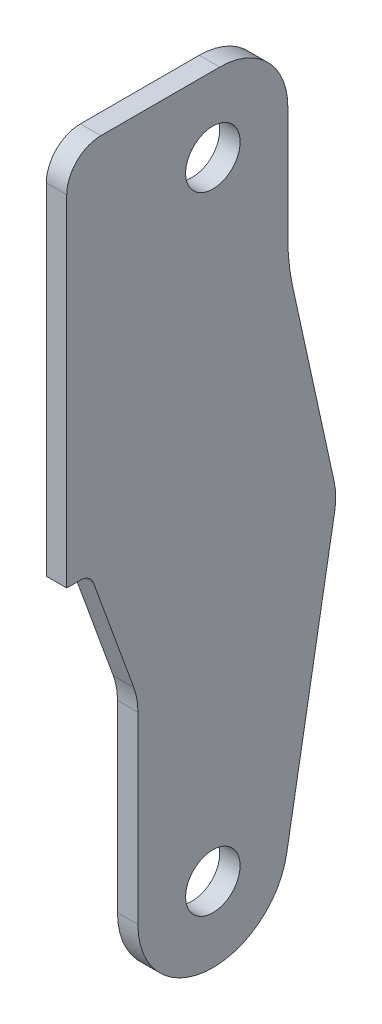
ISO-10303-21;
HEADER;
FILE_DESCRIPTION(('STEP AP214'),'2;1');
FILE_NAME('part.step','',(''),(''),'','','');
FILE_SCHEMA(('AUTOMOTIVE_DESIGN { 1 0 10303 214 1 1 1 1 }'));
ENDSEC;
DATA;
#1=APPLICATION_CONTEXT('core data for automotive mechanical design processes');
#2=APPLICATION_PROTOCOL_DEFINITION('international standard','automotive_design',2000,#1);
#3=PRODUCT_CONTEXT('',#1,'mechanical');
#4=PRODUCT('Part','Part','',(#3));
#5=PRODUCT_RELATED_PRODUCT_CATEGORY('part','',(#4));
#6=PRODUCT_DEFINITION_FORMATION('','',#4);
#7=PRODUCT_DEFINITION_CONTEXT('part definition',#1,'design');
#8=PRODUCT_DEFINITION('design','',#6,#7);
#9=PRODUCT_DEFINITION_SHAPE('','',#8);
#10=(LENGTH_UNIT() NAMED_UNIT(*) SI_UNIT(.MILLI.,.METRE.));
#11=(NAMED_UNIT(*) PLANE_ANGLE_UNIT() SI_UNIT($,.RADIAN.));
#12=(NAMED_UNIT(*) SI_UNIT($,.STERADIAN.) SOLID_ANGLE_UNIT());
#13=UNCERTAINTY_MEASURE_WITH_UNIT(LENGTH_MEASURE(1.E-05),#10,'distance_accuracy_value','');
#14=(GEOMETRIC_REPRESENTATION_CONTEXT(3) GLOBAL_UNCERTAINTY_ASSIGNED_CONTEXT((#13)) GLOBAL_UNIT_ASSIGNED_CONTEXT((#10,
#11,#12)) REPRESENTATION_CONTEXT('',''));
#15=CARTESIAN_POINT('',(0.,0.,0.));
#16=DIRECTION('',(0.,0.,1.));
#17=DIRECTION('',(1.,0.,0.));
#18=AXIS2_PLACEMENT_3D('',#15,#16,#17);
#19=CARTESIAN_POINT('',(17.5,-190.,21.4494897427832));
#20=DIRECTION('',(0.,0.,1.));
#21=DIRECTION('',(1.,0.,0.));
#22=AXIS2_PLACEMENT_3D('',#19,#20,#21);
#23=PLANE('',#22);
#24=DIRECTION('',(0.,1.,0.));
#25=VECTOR('',#24,1.);
#26=CARTESIAN_POINT('',(17.5,-190.,21.4494897427832));
#27=LINE('',#26,#25);
#28=CARTESIAN_POINT('',(17.5,-190.,21.4494897427832));
#29=VERTEX_POINT('',#28);
#30=CARTESIAN_POINT('',(17.5,-140.,21.4494897427832));
#31=VERTEX_POINT('',#30);
#32=EDGE_CURVE('E184',#29,#31,#27,.T.);
#33=ORIENTED_EDGE('',*,*,#32,.T.);
#34=DIRECTION('',(-1.,0.,0.));
#35=VECTOR('',#34,1.);
#36=CARTESIAN_POINT('',(17.5,-140.,21.4494897427832));
#37=LINE('',#36,#35);
#38=CARTESIAN_POINT('',(14.5,-140.,21.4494897427832));
#39=VERTEX_POINT('',#38);
#40=EDGE_CURVE('E252',#31,#39,#37,.T.);
#41=ORIENTED_EDGE('',*,*,#40,.T.);
#42=DIRECTION('',(0.,1.,0.));
#43=VECTOR('',#42,1.);
#44=CARTESIAN_POINT('',(14.5,-190.,21.4494897427832));
#45=LINE('',#44,#43);
#46=CARTESIAN_POINT('',(14.5,-190.,21.4494897427832));
#47=VERTEX_POINT('',#46);
#48=EDGE_CURVE('E180',#47,#39,#45,.T.);
#49=ORIENTED_EDGE('',*,*,#48,.F.);
#50=DIRECTION('',(-1.,0.,0.));
#51=VECTOR('',#50,1.);
#52=CARTESIAN_POINT('',(17.5,-190.,21.4494897427832));
#53=LINE('',#52,#51);
#54=EDGE_CURVE('E250',#29,#47,#53,.T.);
#55=ORIENTED_EDGE('',*,*,#54,.F.);
#56=EDGE_LOOP('',(#33,#41,#49,#55));
#57=FACE_BOUND('',#56,.T.);
#58=ADVANCED_FACE('F39',(#57),#23,.T.);
#59=CARTESIAN_POINT('',(17.5,-190.000000000001,19.40041507642));
#60=DIRECTION('',(0.,-1.,5.28271354274638E-13));
#61=DIRECTION('',(0.,-5.28271354274638E-13,-1.));
#62=AXIS2_PLACEMENT_3D('',#59,#60,#61);
#63=PLANE('',#62);
#64=ORIENTED_EDGE('',*,*,#54,.T.);
#65=DIRECTION('',(0.,5.28271354274638E-13,1.));
#66=VECTOR('',#65,1.);
#67=CARTESIAN_POINT('',(14.5,-190.000000000001,19.40041507642));
#68=LINE('',#67,#66);
#69=CARTESIAN_POINT('',(14.5,-190.000000000002,19.40041507642));
#70=VERTEX_POINT('',#69);
#71=EDGE_CURVE('E188',#70,#47,#68,.T.);
#72=ORIENTED_EDGE('',*,*,#71,.F.);
#73=DIRECTION('',(-1.,0.,0.));
#74=VECTOR('',#73,1.);
#75=CARTESIAN_POINT('',(17.5,-190.000000000002,19.40041507642));
#76=LINE('',#75,#74);
#77=CARTESIAN_POINT('',(17.5,-190.000000000002,19.40041507642));
#78=VERTEX_POINT('',#77);
#79=EDGE_CURVE('E253',#78,#70,#76,.T.);
#80=ORIENTED_EDGE('',*,*,#79,.F.);
#81=DIRECTION('',(0.,5.28271354274638E-13,1.));
#82=VECTOR('',#81,1.);
#83=CARTESIAN_POINT('',(17.5,-190.000000000001,19.40041507642));
#84=LINE('',#83,#82);
#85=EDGE_CURVE('E218',#78,#29,#84,.T.);
#86=ORIENTED_EDGE('',*,*,#85,.T.);
#87=EDGE_LOOP('',(#64,#72,#80,#86));
#88=FACE_BOUND('',#87,.T.);
#89=ADVANCED_FACE('F283',(#88),#63,.T.);
#90=CARTESIAN_POINT('',(17.5,-192.,19.40041507642));
#91=DIRECTION('',(-1.,0.,0.));
#92=DIRECTION('',(0.,0.,1.));
#93=AXIS2_PLACEMENT_3D('',#90,#91,#92);
#94=CYLINDRICAL_SURFACE('',#93,1.99999999999838);
#95=ORIENTED_EDGE('',*,*,#79,.T.);
#96=CARTESIAN_POINT('',(14.5,-192.,19.40041507642));
#97=DIRECTION('',(1.,0.,0.));
#98=DIRECTION('',(0.,0.,1.));
#99=AXIS2_PLACEMENT_3D('',#96,#97,#98);
#100=CIRCLE('',#99,1.99999999999838);
#101=CARTESIAN_POINT('',(14.5,-191.31595971335,17.52102983485));
#102=VERTEX_POINT('',#101);
#103=EDGE_CURVE('E245',#102,#70,#100,.T.);
#104=ORIENTED_EDGE('',*,*,#103,.F.);
#105=DIRECTION('',(-1.,0.,0.));
#106=VECTOR('',#105,1.);
#107=CARTESIAN_POINT('',(17.5,-191.31595971335,17.52102983485));
#108=LINE('',#107,#106);
#109=CARTESIAN_POINT('',(17.5,-191.31595971335,17.52102983485));
#110=VERTEX_POINT('',#109);
#111=EDGE_CURVE('E255',#110,#102,#108,.T.);
#112=ORIENTED_EDGE('',*,*,#111,.F.);
#113=CARTESIAN_POINT('',(17.5,-192.,19.40041507642));
#114=DIRECTION('',(1.,0.,0.));
#115=DIRECTION('',(0.,0.,1.));
#116=AXIS2_PLACEMENT_3D('',#113,#114,#115);
#117=CIRCLE('',#116,1.99999999999838);
#118=EDGE_CURVE('E215',#110,#78,#117,.T.);
#119=ORIENTED_EDGE('',*,*,#118,.T.);
#120=EDGE_LOOP('',(#95,#104,#112,#119));
#121=FACE_BOUND('',#120,.T.);
#122=ADVANCED_FACE('F303',(#121),#94,.F.);
#123=CARTESIAN_POINT('',(17.5,-207.57541031001,11.6030737921409));
#124=DIRECTION('',(0.,-0.342020143325815,0.939692620785855));
#125=DIRECTION('',(0.,-0.939692620785855,-0.342020143325815));
#126=AXIS2_PLACEMENT_3D('',#123,#124,#125);
#127=PLANE('',#126);
#128=ORIENTED_EDGE('',*,*,#111,.T.);
#129=DIRECTION('',(0.,0.939692620785855,0.342020143325814));
#130=VECTOR('',#129,1.);
#131=CARTESIAN_POINT('',(14.5,-207.57541031001,11.6030737921409));
#132=LINE('',#131,#130);
#133=CARTESIAN_POINT('',(14.5,-207.575410310011,11.6030737921414));
#134=VERTEX_POINT('',#133);
#135=EDGE_CURVE('E242',#134,#102,#132,.T.);
#136=ORIENTED_EDGE('',*,*,#135,.F.);
#137=DIRECTION('',(-1.,0.,0.));
#138=VECTOR('',#137,1.);
#139=CARTESIAN_POINT('',(17.5,-207.575410310011,11.6030737921414));
#140=LINE('',#139,#138);
#141=CARTESIAN_POINT('',(17.5,-207.575410310011,11.6030737921414));
#142=VERTEX_POINT('',#141);
#143=EDGE_CURVE('E257',#142,#134,#140,.T.);
#144=ORIENTED_EDGE('',*,*,#143,.F.);
#145=DIRECTION('',(0.,0.939692620785855,0.342020143325814));
#146=VECTOR('',#145,1.);
#147=CARTESIAN_POINT('',(17.5,-207.57541031001,11.6030737921409));
#148=LINE('',#147,#146);
#149=EDGE_CURVE('E212',#142,#110,#148,.T.);
#150=ORIENTED_EDGE('',*,*,#149,.T.);
#151=EDGE_LOOP('',(#128,#136,#144,#150));
#152=FACE_BOUND('',#151,.T.);
#153=ADVANCED_FACE('F338',(#152),#127,.T.);
#154=CARTESIAN_POINT('',(17.5,-210.99561174327,21.));
#155=DIRECTION('',(-1.,0.,0.));
#156=DIRECTION('',(0.,0.,1.));
#157=AXIS2_PLACEMENT_3D('',#154,#155,#156);
#158=CYLINDRICAL_SURFACE('',#157,10.0000000000005);
#159=ORIENTED_EDGE('',*,*,#143,.T.);
#160=CARTESIAN_POINT('',(14.5,-210.99561174327,21.));
#161=DIRECTION('',(1.,0.,0.));
#162=DIRECTION('',(0.,0.,1.));
#163=AXIS2_PLACEMENT_3D('',#160,#161,#162);
#164=CIRCLE('',#163,10.0000000000005);
#165=CARTESIAN_POINT('',(14.5,-210.99561174327,11.));
#166=VERTEX_POINT('',#165);
#167=EDGE_CURVE('E239',#166,#134,#164,.T.);
#168=ORIENTED_EDGE('',*,*,#167,.F.);
#169=DIRECTION('',(-1.,0.,0.));
#170=VECTOR('',#169,1.);
#171=CARTESIAN_POINT('',(17.5,-210.99561174327,11.));
#172=LINE('',#171,#170);
#173=CARTESIAN_POINT('',(17.5,-210.99561174327,11.));
#174=VERTEX_POINT('',#173);
#175=EDGE_CURVE('E259',#174,#166,#172,.T.);
#176=ORIENTED_EDGE('',*,*,#175,.F.);
#177=CARTESIAN_POINT('',(17.5,-210.99561174327,21.));
#178=DIRECTION('',(1.,0.,0.));
#179=DIRECTION('',(0.,0.,1.));
#180=AXIS2_PLACEMENT_3D('',#177,#178,#179);
#181=CIRCLE('',#180,10.0000000000005);
#182=EDGE_CURVE('E209',#174,#142,#181,.T.);
#183=ORIENTED_EDGE('',*,*,#182,.T.);
#184=EDGE_LOOP('',(#159,#168,#176,#183));
#185=FACE_BOUND('',#184,.T.);
#186=ADVANCED_FACE('F334',(#185),#158,.F.);
#187=CARTESIAN_POINT('',(17.5,-238.,10.9999999999979));
#188=DIRECTION('',(0.,0.,1.));
#189=DIRECTION('',(0.,-1.,0.));
#190=AXIS2_PLACEMENT_3D('',#187,#188,#189);
#191=PLANE('',#190);
#192=ORIENTED_EDGE('',*,*,#175,.T.);
#193=DIRECTION('',(0.,1.,0.));
#194=VECTOR('',#193,1.);
#195=CARTESIAN_POINT('',(14.5,-238.,10.9999999999979));
#196=LINE('',#195,#194);
#197=CARTESIAN_POINT('',(14.5,-238.,10.9999999999969));
#198=VERTEX_POINT('',#197);
#199=EDGE_CURVE('E236',#198,#166,#196,.T.);
#200=ORIENTED_EDGE('',*,*,#199,.F.);
#201=DIRECTION('',(-1.,0.,0.));
#202=VECTOR('',#201,1.);
#203=CARTESIAN_POINT('',(17.5,-238.,10.9999999999969));
#204=LINE('',#203,#202);
#205=CARTESIAN_POINT('',(17.5,-238.,10.9999999999969));
#206=VERTEX_POINT('',#205);
#207=EDGE_CURVE('E261',#206,#198,#204,.T.);
#208=ORIENTED_EDGE('',*,*,#207,.F.);
#209=DIRECTION('',(0.,1.,0.));
#210=VECTOR('',#209,1.);
#211=CARTESIAN_POINT('',(17.5,-238.,10.9999999999979));
#212=LINE('',#211,#210);
#213=EDGE_CURVE('E206',#206,#174,#212,.T.);
#214=ORIENTED_EDGE('',*,*,#213,.T.);
#215=EDGE_LOOP('',(#192,#200,#208,#214));
#216=FACE_BOUND('',#215,.T.);
#217=ADVANCED_FACE('F330',(#216),#191,.T.);
#218=CARTESIAN_POINT('',(17.5,-238.,0.));
#219=DIRECTION('',(-1.,0.,0.));
#220=DIRECTION('',(0.,0.,1.));
#221=AXIS2_PLACEMENT_3D('',#218,#219,#220);
#222=CYLINDRICAL_SURFACE('',#221,10.9999999999969);
#223=ORIENTED_EDGE('',*,*,#207,.T.);
#224=CARTESIAN_POINT('',(14.5,-238.,0.));
#225=DIRECTION('',(-1.,0.,0.));
#226=DIRECTION('',(0.,0.,1.));
#227=AXIS2_PLACEMENT_3D('',#224,#225,#226);
#228=CIRCLE('',#227,10.9999999999969);
#229=CARTESIAN_POINT('',(14.5,-239.91012995434,-10.83288528313));
#230=VERTEX_POINT('',#229);
#231=EDGE_CURVE('E233',#230,#198,#228,.T.);
#232=ORIENTED_EDGE('',*,*,#231,.F.);
#233=DIRECTION('',(-1.,0.,0.));
#234=VECTOR('',#233,1.);
#235=CARTESIAN_POINT('',(17.5,-239.91012995434,-10.83288528313));
#236=LINE('',#235,#234);
#237=CARTESIAN_POINT('',(17.5,-239.91012995434,-10.83288528313));
#238=VERTEX_POINT('',#237);
#239=EDGE_CURVE('E263',#238,#230,#236,.T.);
#240=ORIENTED_EDGE('',*,*,#239,.F.);
#241=CARTESIAN_POINT('',(17.5,-238.,0.));
#242=DIRECTION('',(-1.,0.,0.));
#243=DIRECTION('',(0.,0.,1.));
#244=AXIS2_PLACEMENT_3D('',#241,#242,#243);
#245=CIRCLE('',#244,10.9999999999963);
#246=EDGE_CURVE('E204',#238,#206,#245,.T.);
#247=ORIENTED_EDGE('',*,*,#246,.T.);
#248=EDGE_LOOP('',(#223,#232,#240,#247));
#249=FACE_BOUND('',#248,.T.);
#250=ADVANCED_FACE('F326',(#249),#222,.T.);
#251=CARTESIAN_POINT('',(17.5,-199.94512735731,-17.8797935250715));
#252=DIRECTION('',(0.,-0.173648177666962,-0.984807753012202));
#253=DIRECTION('',(0.,0.984807753012202,-0.173648177666962));
#254=AXIS2_PLACEMENT_3D('',#251,#252,#253);
#255=PLANE('',#254);
#256=ORIENTED_EDGE('',*,*,#239,.T.);
#257=DIRECTION('',(0.,-0.984807753012202,0.173648177666962));
#258=VECTOR('',#257,1.);
#259=CARTESIAN_POINT('',(14.5,-199.94512735731,-17.8797935250715));
#260=LINE('',#259,#258);
#261=CARTESIAN_POINT('',(14.5,-199.94512735731,-17.8797935250723));
#262=VERTEX_POINT('',#261);
#263=EDGE_CURVE('E230',#262,#230,#260,.T.);
#264=ORIENTED_EDGE('',*,*,#263,.F.);
#265=DIRECTION('',(-1.,0.,0.));
#266=VECTOR('',#265,1.);
#267=CARTESIAN_POINT('',(17.5,-199.94512735731,-17.8797935250723));
#268=LINE('',#267,#266);
#269=CARTESIAN_POINT('',(17.5,-199.94512735731,-17.8797935250723));
#270=VERTEX_POINT('',#269);
#271=EDGE_CURVE('E265',#270,#262,#268,.T.);
#272=ORIENTED_EDGE('',*,*,#271,.F.);
#273=DIRECTION('',(0.,-0.984807753012202,0.173648177666962));
#274=VECTOR('',#273,1.);
#275=CARTESIAN_POINT('',(17.5,-199.94512735731,-17.8797935250715));
#276=LINE('',#275,#274);
#277=EDGE_CURVE('E201',#270,#238,#276,.T.);
#278=ORIENTED_EDGE('',*,*,#277,.T.);
#279=EDGE_LOOP('',(#256,#264,#272,#278));
#280=FACE_BOUND('',#279,.T.);
#281=ADVANCED_FACE('F322',(#280),#255,.T.);
#282=CARTESIAN_POINT('',(17.5,-198.20864558064,-8.031715994952));
#283=DIRECTION('',(-1.,0.,0.));
#284=DIRECTION('',(0.,0.,1.));
#285=AXIS2_PLACEMENT_3D('',#282,#283,#284);
#286=CYLINDRICAL_SURFACE('',#285,9.99999999999843);
#287=ORIENTED_EDGE('',*,*,#271,.T.);
#288=CARTESIAN_POINT('',(14.5,-198.20864558064,-8.031715994952));
#289=DIRECTION('',(-1.,0.,0.));
#290=DIRECTION('',(0.,0.,1.));
#291=AXIS2_PLACEMENT_3D('',#288,#289,#290);
#292=CIRCLE('',#291,9.99999999999843);
#293=CARTESIAN_POINT('',(14.5,-196.07054058552,-17.80046755438));
#294=VERTEX_POINT('',#293);
#295=EDGE_CURVE('E227',#294,#262,#292,.T.);
#296=ORIENTED_EDGE('',*,*,#295,.F.);
#297=DIRECTION('',(-1.,0.,0.));
#298=VECTOR('',#297,1.);
#299=CARTESIAN_POINT('',(17.5,-196.07054058552,-17.80046755438));
#300=LINE('',#299,#298);
#301=CARTESIAN_POINT('',(17.5,-196.07054058552,-17.80046755438));
#302=VERTEX_POINT('',#301);
#303=EDGE_CURVE('E267',#302,#294,#300,.T.);
#304=ORIENTED_EDGE('',*,*,#303,.F.);
#305=CARTESIAN_POINT('',(17.5,-198.20864558064,-8.031715994952));
#306=DIRECTION('',(-1.,0.,0.));
#307=DIRECTION('',(0.,0.,1.));
#308=AXIS2_PLACEMENT_3D('',#305,#306,#307);
#309=CIRCLE('',#308,9.99999999999843);
#310=EDGE_CURVE('E198',#302,#270,#309,.T.);
#311=ORIENTED_EDGE('',*,*,#310,.T.);
#312=EDGE_LOOP('',(#287,#296,#304,#311));
#313=FACE_BOUND('',#312,.T.);
#314=ADVANCED_FACE('F318',(#313),#286,.T.);
#315=CARTESIAN_POINT('',(17.5,-168.16964120508,-11.6937453217096));
#316=DIRECTION('',(0.,0.213810499511105,-0.976875155943077));
#317=DIRECTION('',(0.,0.976875155943077,0.213810499511105));
#318=AXIS2_PLACEMENT_3D('',#315,#316,#317);
#319=PLANE('',#318);
#320=ORIENTED_EDGE('',*,*,#303,.T.);
#321=DIRECTION('',(0.,-0.976875155943077,-0.213810499511105));
#322=VECTOR('',#321,1.);
#323=CARTESIAN_POINT('',(14.5,-168.16964120508,-11.6937453217096));
#324=LINE('',#323,#322);
#325=CARTESIAN_POINT('',(14.5,-168.16964120508,-11.6937453217094));
#326=VERTEX_POINT('',#325);
#327=EDGE_CURVE('E224',#326,#294,#324,.T.);
#328=ORIENTED_EDGE('',*,*,#327,.F.);
#329=DIRECTION('',(-1.,0.,0.));
#330=VECTOR('',#329,1.);
#331=CARTESIAN_POINT('',(17.5,-168.16964120508,-11.6937453217094));
#332=LINE('',#331,#330);
#333=CARTESIAN_POINT('',(17.5,-168.16964120508,-11.6937453217094));
#334=VERTEX_POINT('',#333);
#335=EDGE_CURVE('E269',#334,#326,#332,.T.);
#336=ORIENTED_EDGE('',*,*,#335,.F.);
#337=DIRECTION('',(0.,-0.976875155943077,-0.213810499511105));
#338=VECTOR('',#337,1.);
#339=CARTESIAN_POINT('',(17.5,-168.16964120508,-11.6937453217096));
#340=LINE('',#339,#338);
#341=EDGE_CURVE('E195',#334,#302,#340,.T.);
#342=ORIENTED_EDGE('',*,*,#341,.T.);
#343=EDGE_LOOP('',(#320,#328,#336,#342));
#344=FACE_BOUND('',#343,.T.);
#345=ADVANCED_FACE('F314',(#344),#319,.T.);
#346=CARTESIAN_POINT('',(17.5,-161.75532621974,-41.));
#347=DIRECTION('',(-1.,0.,0.));
#348=DIRECTION('',(0.,0.,1.));
#349=AXIS2_PLACEMENT_3D('',#346,#347,#348);
#350=CYLINDRICAL_SURFACE('',#349,29.9999999999998);
#351=ORIENTED_EDGE('',*,*,#335,.T.);
#352=CARTESIAN_POINT('',(14.5,-161.75532621974,-41.));
#353=DIRECTION('',(1.,0.,0.));
#354=DIRECTION('',(0.,0.,1.));
#355=AXIS2_PLACEMENT_3D('',#352,#353,#354);
#356=CIRCLE('',#355,29.9999999999998);
#357=CARTESIAN_POINT('',(14.5,-161.75532621974,-11.));
#358=VERTEX_POINT('',#357);
#359=EDGE_CURVE('E153',#358,#326,#356,.T.);
#360=ORIENTED_EDGE('',*,*,#359,.F.);
#361=DIRECTION('',(-1.,0.,0.));
#362=VECTOR('',#361,1.);
#363=CARTESIAN_POINT('',(17.5,-161.75532621974,-11.));
#364=LINE('',#363,#362);
#365=CARTESIAN_POINT('',(17.5,-161.75532621974,-11.));
#366=VERTEX_POINT('',#365);
#367=EDGE_CURVE('E149',#366,#358,#364,.T.);
#368=ORIENTED_EDGE('',*,*,#367,.F.);
#369=CARTESIAN_POINT('',(17.5,-161.75532621974,-41.));
#370=DIRECTION('',(1.,0.,0.));
#371=DIRECTION('',(0.,0.,1.));
#372=AXIS2_PLACEMENT_3D('',#369,#370,#371);
#373=CIRCLE('',#372,29.9999999999998);
#374=EDGE_CURVE('E192',#366,#334,#373,.T.);
#375=ORIENTED_EDGE('',*,*,#374,.T.);
#376=EDGE_LOOP('',(#351,#360,#368,#375));
#377=FACE_BOUND('',#376,.T.);
#378=ADVANCED_FACE('F311',(#377),#350,.F.);
#379=CARTESIAN_POINT('',(17.5,-153.292893218813,-10.9999999999989));
#380=DIRECTION('',(0.,1.32834234824646E-13,-1.));
#381=DIRECTION('',(0.,1.,1.32834234824646E-13));
#382=AXIS2_PLACEMENT_3D('',#379,#380,#381);
#383=PLANE('',#382);
#384=ORIENTED_EDGE('',*,*,#367,.T.);
#385=DIRECTION('',(0.,-1.,-1.32834234824646E-13));
#386=VECTOR('',#385,1.);
#387=CARTESIAN_POINT('',(14.5,-153.292893218813,-10.9999999999989));
#388=LINE('',#387,#386);
#389=CARTESIAN_POINT('',(14.5,-145.,-10.9999999999983));
#390=VERTEX_POINT('',#389);
#391=EDGE_CURVE('E144',#390,#358,#388,.T.);
#392=ORIENTED_EDGE('',*,*,#391,.F.);
#393=DIRECTION('',(-1.,0.,0.));
#394=VECTOR('',#393,1.);
#395=CARTESIAN_POINT('',(43.370057685087,-145.,-10.9999999999983));
#396=LINE('',#395,#394);
#397=CARTESIAN_POINT('',(17.5,-145.,-10.9999999999983));
#398=VERTEX_POINT('',#397);
#399=EDGE_CURVE('E148',#398,#390,#396,.T.);
#400=ORIENTED_EDGE('',*,*,#399,.F.);
#401=DIRECTION('',(0.,-1.,-1.32834234824646E-13));
#402=VECTOR('',#401,1.);
#403=CARTESIAN_POINT('',(17.5,-153.292893218813,-10.9999999999989));
#404=LINE('',#403,#402);
#405=EDGE_CURVE('E190',#398,#366,#404,.T.);
#406=ORIENTED_EDGE('',*,*,#405,.T.);
#407=EDGE_LOOP('',(#384,#392,#400,#406));
#408=FACE_BOUND('',#407,.T.);
#409=ADVANCED_FACE('F146',(#408),#383,.T.);
#410=CARTESIAN_POINT('',(17.5,-135.,21.4494897427832));
#411=DIRECTION('',(0.,1.,0.));
#412=DIRECTION('',(0.,0.,1.));
#413=AXIS2_PLACEMENT_3D('',#410,#411,#412);
#414=PLANE('',#413);
#415=DIRECTION('',(0.,0.,-1.));
#416=VECTOR('',#415,1.);
#417=CARTESIAN_POINT('',(14.5,-135.,21.4494897427832));
#418=LINE('',#417,#416);
#419=CARTESIAN_POINT('',(14.5,-135.,16.4494897427832));
#420=VERTEX_POINT('',#419);
#421=CARTESIAN_POINT('',(14.5,-135.,-0.999999999998242));
#422=VERTEX_POINT('',#421);
#423=EDGE_CURVE('E154',#420,#422,#418,.T.);
#424=ORIENTED_EDGE('',*,*,#423,.F.);
#425=DIRECTION('',(-1.,0.,0.));
#426=VECTOR('',#425,1.);
#427=CARTESIAN_POINT('',(17.5,-135.,16.4494897427832));
#428=LINE('',#427,#426);
#429=CARTESIAN_POINT('',(17.5,-135.,16.4494897427832));
#430=VERTEX_POINT('',#429);
#431=EDGE_CURVE('E47',#420,#430,#428,.F.);
#432=ORIENTED_EDGE('',*,*,#431,.T.);
#433=DIRECTION('',(0.,0.,-1.));
#434=VECTOR('',#433,1.);
#435=CARTESIAN_POINT('',(17.5,-135.,21.4494897427832));
#436=LINE('',#435,#434);
#437=CARTESIAN_POINT('',(17.5,-135.,-0.999999999998242));
#438=VERTEX_POINT('',#437);
#439=EDGE_CURVE('E187',#430,#438,#436,.T.);
#440=ORIENTED_EDGE('',*,*,#439,.T.);
#441=DIRECTION('',(-1.,0.,0.));
#442=VECTOR('',#441,1.);
#443=CARTESIAN_POINT('',(43.370057685087,-135.,-0.999999999998242));
#444=LINE('',#443,#442);
#445=EDGE_CURVE('E164',#438,#422,#444,.T.);
#446=ORIENTED_EDGE('',*,*,#445,.T.);
#447=EDGE_LOOP('',(#424,#432,#440,#446));
#448=FACE_BOUND('',#447,.T.);
#449=ADVANCED_FACE('F306',(#448),#414,.T.);
#450=CARTESIAN_POINT('',(17.5,-137.,7.292893218813));
#451=DIRECTION('',(-1.,0.,0.));
#452=DIRECTION('',(0.,0.,1.));
#453=AXIS2_PLACEMENT_3D('',#450,#451,#452);
#454=PLANE('',#453);
#455=CARTESIAN_POINT('',(17.5,-146.,1.54459778300975E-11));
#456=DIRECTION('',(-1.,0.,0.));
#457=DIRECTION('',(0.,0.,1.));
#458=AXIS2_PLACEMENT_3D('',#455,#456,#457);
#459=CIRCLE('',#458,3.99999999998523);
#460=CARTESIAN_POINT('',(17.5,-146.,4.00000000000068));
#461=VERTEX_POINT('',#460);
#462=EDGE_CURVE('E169',#461,#461,#459,.T.);
#463=ORIENTED_EDGE('',*,*,#462,.T.);
#464=EDGE_LOOP('',(#463));
#465=FACE_BOUND('',#464,.T.);
#466=ORIENTED_EDGE('',*,*,#439,.F.);
#467=CARTESIAN_POINT('',(17.5,-140.,16.4494897427832));
#468=DIRECTION('',(-1.,0.,0.));
#469=DIRECTION('',(0.,0.,1.));
#470=AXIS2_PLACEMENT_3D('',#467,#468,#469);
#471=CIRCLE('',#470,5.);
#472=EDGE_CURVE('E11',#430,#31,#471,.F.);
#473=ORIENTED_EDGE('',*,*,#472,.T.);
#474=ORIENTED_EDGE('',*,*,#32,.F.);
#475=ORIENTED_EDGE('',*,*,#85,.F.);
#476=ORIENTED_EDGE('',*,*,#118,.F.);
#477=ORIENTED_EDGE('',*,*,#149,.F.);
#478=ORIENTED_EDGE('',*,*,#182,.F.);
#479=ORIENTED_EDGE('',*,*,#213,.F.);
#480=ORIENTED_EDGE('',*,*,#246,.F.);
#481=ORIENTED_EDGE('',*,*,#277,.F.);
#482=ORIENTED_EDGE('',*,*,#310,.F.);
#483=ORIENTED_EDGE('',*,*,#341,.F.);
#484=ORIENTED_EDGE('',*,*,#374,.F.);
#485=ORIENTED_EDGE('',*,*,#405,.F.);
#486=CARTESIAN_POINT('',(17.5,-145.,-0.999999999998313));
#487=DIRECTION('',(-1.,0.,0.));
#488=DIRECTION('',(0.,0.,1.));
#489=AXIS2_PLACEMENT_3D('',#486,#487,#488);
#490=CIRCLE('',#489,10.);
#491=EDGE_CURVE('E163',#438,#398,#490,.T.);
#492=ORIENTED_EDGE('',*,*,#491,.F.);
#493=EDGE_LOOP('',(#466,#473,#474,#475,#476,#477,#478,#479,#480,#481,#482,#483,#484,#485,#492));
#494=FACE_BOUND('',#493,.T.);
#495=CARTESIAN_POINT('',(17.5,-237.999999999979,1.54456863965535E-11));
#496=DIRECTION('',(-1.,0.,0.));
#497=DIRECTION('',(0.,0.,1.));
#498=AXIS2_PLACEMENT_3D('',#495,#496,#497);
#499=CIRCLE('',#498,3.99999999997894);
#500=CARTESIAN_POINT('',(17.5,-237.999999999979,3.99999999999439));
#501=VERTEX_POINT('',#500);
#502=EDGE_CURVE('E177',#501,#501,#499,.T.);
#503=ORIENTED_EDGE('',*,*,#502,.T.);
#504=EDGE_LOOP('',(#503));
#505=FACE_BOUND('',#504,.T.);
#506=ADVANCED_FACE('F286',(#465,#494,#505),#454,.F.);
#507=CARTESIAN_POINT('',(14.5,-137.,7.292893218813));
#508=DIRECTION('',(-1.,0.,0.));
#509=DIRECTION('',(0.,0.,1.));
#510=AXIS2_PLACEMENT_3D('',#507,#508,#509);
#511=PLANE('',#510);
#512=CARTESIAN_POINT('',(14.5,-146.,1.54459778300975E-11));
#513=DIRECTION('',(-1.,0.,0.));
#514=DIRECTION('',(0.,0.,1.));
#515=AXIS2_PLACEMENT_3D('',#512,#513,#514);
#516=CIRCLE('',#515,3.99999999998523);
#517=CARTESIAN_POINT('',(14.5,-146.,4.00000000000068));
#518=VERTEX_POINT('',#517);
#519=EDGE_CURVE('E172',#518,#518,#516,.T.);
#520=ORIENTED_EDGE('',*,*,#519,.F.);
#521=EDGE_LOOP('',(#520));
#522=FACE_BOUND('',#521,.T.);
#523=ORIENTED_EDGE('',*,*,#48,.T.);
#524=CARTESIAN_POINT('',(14.5,-140.,16.4494897427832));
#525=DIRECTION('',(-1.,0.,0.));
#526=DIRECTION('',(0.,0.,1.));
#527=AXIS2_PLACEMENT_3D('',#524,#525,#526);
#528=CIRCLE('',#527,5.);
#529=EDGE_CURVE('E61',#39,#420,#528,.T.);
#530=ORIENTED_EDGE('',*,*,#529,.T.);
#531=ORIENTED_EDGE('',*,*,#423,.T.);
#532=CARTESIAN_POINT('',(14.5,-145.,-0.999999999998313));
#533=DIRECTION('',(-1.,0.,0.));
#534=DIRECTION('',(0.,0.,1.));
#535=AXIS2_PLACEMENT_3D('',#532,#533,#534);
#536=CIRCLE('',#535,10.);
#537=EDGE_CURVE('E161',#390,#422,#536,.F.);
#538=ORIENTED_EDGE('',*,*,#537,.F.);
#539=ORIENTED_EDGE('',*,*,#391,.T.);
#540=ORIENTED_EDGE('',*,*,#359,.T.);
#541=ORIENTED_EDGE('',*,*,#327,.T.);
#542=ORIENTED_EDGE('',*,*,#295,.T.);
#543=ORIENTED_EDGE('',*,*,#263,.T.);
#544=ORIENTED_EDGE('',*,*,#231,.T.);
#545=ORIENTED_EDGE('',*,*,#199,.T.);
#546=ORIENTED_EDGE('',*,*,#167,.T.);
#547=ORIENTED_EDGE('',*,*,#135,.T.);
#548=ORIENTED_EDGE('',*,*,#103,.T.);
#549=ORIENTED_EDGE('',*,*,#71,.T.);
#550=EDGE_LOOP('',(#523,#530,#531,#538,#539,#540,#541,#542,#543,#544,#545,#546,#547,#548,#549));
#551=FACE_BOUND('',#550,.T.);
#552=CARTESIAN_POINT('',(14.5,-237.999999999979,1.54456863965535E-11));
#553=DIRECTION('',(-1.,0.,0.));
#554=DIRECTION('',(0.,0.,1.));
#555=AXIS2_PLACEMENT_3D('',#552,#553,#554);
#556=CIRCLE('',#555,3.99999999997894);
#557=CARTESIAN_POINT('',(14.5,-237.999999999979,3.99999999999439));
#558=VERTEX_POINT('',#557);
#559=EDGE_CURVE('E181',#558,#558,#556,.T.);
#560=ORIENTED_EDGE('',*,*,#559,.F.);
#561=EDGE_LOOP('',(#560));
#562=FACE_BOUND('',#561,.T.);
#563=ADVANCED_FACE('F166',(#522,#551,#562),#511,.T.);
#564=CARTESIAN_POINT('',(17.5,-237.999999999979,1.54456863965535E-11));
#565=DIRECTION('',(-1.,0.,0.));
#566=DIRECTION('',(0.,0.,1.));
#567=AXIS2_PLACEMENT_3D('',#564,#565,#566);
#568=CYLINDRICAL_SURFACE('',#567,3.99999999997894);
#569=ORIENTED_EDGE('',*,*,#502,.F.);
#570=EDGE_LOOP('',(#569));
#571=FACE_BOUND('',#570,.T.);
#572=ORIENTED_EDGE('',*,*,#559,.T.);
#573=EDGE_LOOP('',(#572));
#574=FACE_BOUND('',#573,.T.);
#575=ADVANCED_FACE('F297',(#571,#574),#568,.F.);
#576=CARTESIAN_POINT('',(43.370057685087,-145.,-0.999999999998313));
#577=DIRECTION('',(-1.,0.,0.));
#578=DIRECTION('',(0.,0.,1.));
#579=AXIS2_PLACEMENT_3D('',#576,#577,#578);
#580=CYLINDRICAL_SURFACE('',#579,10.);
#581=ORIENTED_EDGE('',*,*,#445,.F.);
#582=ORIENTED_EDGE('',*,*,#491,.T.);
#583=ORIENTED_EDGE('',*,*,#399,.T.);
#584=ORIENTED_EDGE('',*,*,#537,.T.);
#585=EDGE_LOOP('',(#581,#582,#583,#584));
#586=FACE_BOUND('',#585,.T.);
#587=ADVANCED_FACE('F160',(#586),#580,.T.);
#588=CARTESIAN_POINT('',(17.5,-140.,16.4494897427832));
#589=DIRECTION('',(-1.,0.,0.));
#590=DIRECTION('',(0.,0.,1.));
#591=AXIS2_PLACEMENT_3D('',#588,#589,#590);
#592=CYLINDRICAL_SURFACE('',#591,5.);
#593=ORIENTED_EDGE('',*,*,#472,.F.);
#594=ORIENTED_EDGE('',*,*,#431,.F.);
#595=ORIENTED_EDGE('',*,*,#529,.F.);
#596=ORIENTED_EDGE('',*,*,#40,.F.);
#597=EDGE_LOOP('',(#593,#594,#595,#596));
#598=FACE_BOUND('',#597,.T.);
#599=ADVANCED_FACE('F41',(#598),#592,.T.);
#600=CARTESIAN_POINT('',(24.5,-146.,1.54459778300975E-11));
#601=DIRECTION('',(-1.,0.,0.));
#602=DIRECTION('',(0.,0.,1.));
#603=AXIS2_PLACEMENT_3D('',#600,#601,#602);
#604=CYLINDRICAL_SURFACE('',#603,3.99999999998523);
#605=ORIENTED_EDGE('',*,*,#519,.T.);
#606=EDGE_LOOP('',(#605));
#607=FACE_BOUND('',#606,.T.);
#608=ORIENTED_EDGE('',*,*,#462,.F.);
#609=EDGE_LOOP('',(#608));
#610=FACE_BOUND('',#609,.T.);
#611=ADVANCED_FACE('F290',(#607,#610),#604,.F.);
#612=CLOSED_SHELL('',(#58,#89,#122,#153,#186,#217,#250,#281,#314,#345,#378,#409,#449,#506,#563,
#575,#587,#599,#611));
#613=MANIFOLD_SOLID_BREP('B2',#612);
#614=ADVANCED_BREP_SHAPE_REPRESENTATION('',(#18,#613),#14);
#615=SHAPE_DEFINITION_REPRESENTATION(#9,#614);
ENDSEC;
END-ISO-10303-21;
